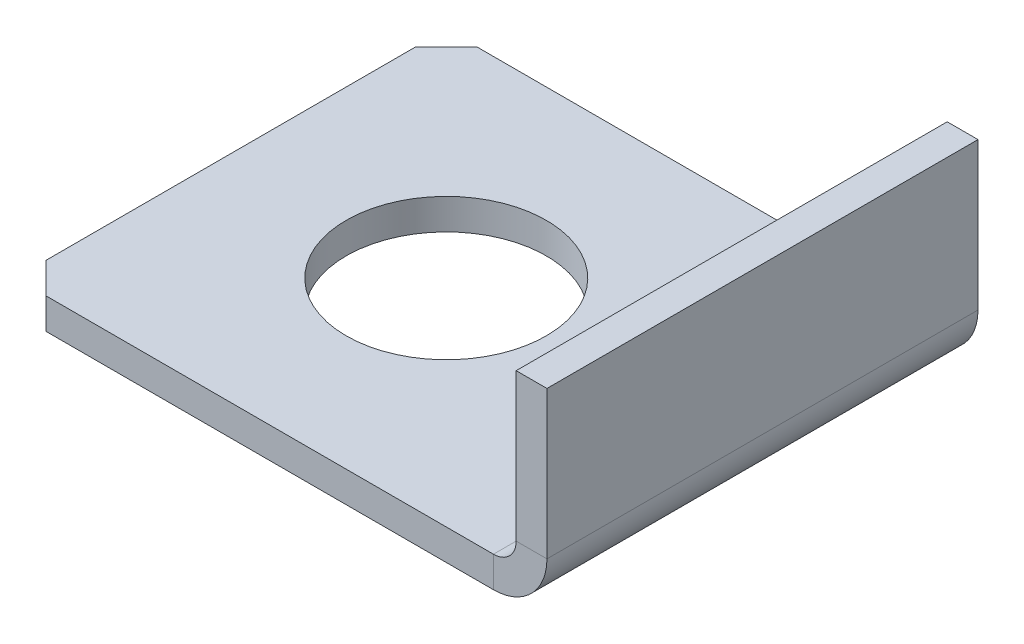
ISO-10303-21;
HEADER;
FILE_DESCRIPTION(('STEP AP214'),'2;1');
FILE_NAME('part.step','',(''),(''),'','','');
FILE_SCHEMA(('AUTOMOTIVE_DESIGN { 1 0 10303 214 1 1 1 1 }'));
ENDSEC;
DATA;
#1=APPLICATION_CONTEXT('core data for automotive mechanical design processes');
#2=APPLICATION_PROTOCOL_DEFINITION('international standard','automotive_design',2000,#1);
#3=PRODUCT_CONTEXT('',#1,'mechanical');
#4=PRODUCT('Part','Part','',(#3));
#5=PRODUCT_RELATED_PRODUCT_CATEGORY('part','',(#4));
#6=PRODUCT_DEFINITION_FORMATION('','',#4);
#7=PRODUCT_DEFINITION_CONTEXT('part definition',#1,'design');
#8=PRODUCT_DEFINITION('design','',#6,#7);
#9=PRODUCT_DEFINITION_SHAPE('','',#8);
#10=(LENGTH_UNIT() NAMED_UNIT(*) SI_UNIT(.MILLI.,.METRE.));
#11=(NAMED_UNIT(*) PLANE_ANGLE_UNIT() SI_UNIT($,.RADIAN.));
#12=(NAMED_UNIT(*) SI_UNIT($,.STERADIAN.) SOLID_ANGLE_UNIT());
#13=UNCERTAINTY_MEASURE_WITH_UNIT(LENGTH_MEASURE(1.E-05),#10,'distance_accuracy_value','');
#14=(GEOMETRIC_REPRESENTATION_CONTEXT(3) GLOBAL_UNCERTAINTY_ASSIGNED_CONTEXT((#13)) GLOBAL_UNIT_ASSIGNED_CONTEXT((#10,
#11,#12)) REPRESENTATION_CONTEXT('',''));
#15=CARTESIAN_POINT('',(0.,0.,0.));
#16=DIRECTION('',(0.,0.,1.));
#17=DIRECTION('',(1.,0.,0.));
#18=AXIS2_PLACEMENT_3D('',#15,#16,#17);
#19=CARTESIAN_POINT('',(22.27,0.,-14.));
#20=DIRECTION('',(0.,-1.,0.));
#21=DIRECTION('',(0.,0.,-1.));
#22=AXIS2_PLACEMENT_3D('',#19,#20,#21);
#23=PLANE('',#22);
#24=DIRECTION('',(0.,0.,-1.));
#25=VECTOR('',#24,1.);
#26=CARTESIAN_POINT('',(15.5334,0.,-14.));
#27=LINE('',#26,#25);
#28=CARTESIAN_POINT('',(15.5334,0.,0.));
#29=VERTEX_POINT('',#28);
#30=CARTESIAN_POINT('',(15.5334,0.,-14.));
#31=VERTEX_POINT('',#30);
#32=EDGE_CURVE('E183',#29,#31,#27,.T.);
#33=ORIENTED_EDGE('',*,*,#32,.F.);
#34=DIRECTION('',(1.,0.,0.));
#35=VECTOR('',#34,1.);
#36=CARTESIAN_POINT('',(1.,0.,0.));
#37=LINE('',#36,#35);
#38=CARTESIAN_POINT('',(1.,0.,0.));
#39=VERTEX_POINT('',#38);
#40=EDGE_CURVE('E149',#39,#29,#37,.T.);
#41=ORIENTED_EDGE('',*,*,#40,.F.);
#42=DIRECTION('',(0.707106781186548,0.,0.707106781186548));
#43=VECTOR('',#42,1.);
#44=CARTESIAN_POINT('',(0.,0.,-1.));
#45=LINE('',#44,#43);
#46=CARTESIAN_POINT('',(0.,0.,-1.));
#47=VERTEX_POINT('',#46);
#48=EDGE_CURVE('E181',#47,#39,#45,.T.);
#49=ORIENTED_EDGE('',*,*,#48,.F.);
#50=DIRECTION('',(0.,0.,1.));
#51=VECTOR('',#50,1.);
#52=CARTESIAN_POINT('',(0.,0.,-1.));
#53=LINE('',#52,#51);
#54=CARTESIAN_POINT('',(0.,0.,-13.));
#55=VERTEX_POINT('',#54);
#56=EDGE_CURVE('E176',#55,#47,#53,.T.);
#57=ORIENTED_EDGE('',*,*,#56,.F.);
#58=DIRECTION('',(-0.707106781186547,0.,0.707106781186548));
#59=VECTOR('',#58,1.);
#60=CARTESIAN_POINT('',(0.,0.,-13.));
#61=LINE('',#60,#59);
#62=CARTESIAN_POINT('',(1.,0.,-14.));
#63=VERTEX_POINT('',#62);
#64=EDGE_CURVE('E171',#63,#55,#61,.T.);
#65=ORIENTED_EDGE('',*,*,#64,.F.);
#66=DIRECTION('',(-1.,0.,0.));
#67=VECTOR('',#66,1.);
#68=CARTESIAN_POINT('',(1.,0.,-14.));
#69=LINE('',#68,#67);
#70=EDGE_CURVE('E155',#31,#63,#69,.T.);
#71=ORIENTED_EDGE('',*,*,#70,.F.);
#72=EDGE_LOOP('',(#33,#41,#49,#57,#65,#71));
#73=FACE_BOUND('',#72,.T.);
#74=CARTESIAN_POINT('',(7.,0.,-7.));
#75=DIRECTION('',(0.,1.,0.));
#76=DIRECTION('',(0.,0.,1.));
#77=AXIS2_PLACEMENT_3D('',#74,#75,#76);
#78=CIRCLE('',#77,3.25);
#79=CARTESIAN_POINT('',(7.,0.,-3.75));
#80=VERTEX_POINT('',#79);
#81=EDGE_CURVE('E224',#80,#80,#78,.T.);
#82=ORIENTED_EDGE('',*,*,#81,.T.);
#83=EDGE_LOOP('',(#82));
#84=FACE_BOUND('',#83,.T.);
#85=ADVANCED_FACE('F36',(#73,#84),#23,.T.);
#86=CARTESIAN_POINT('',(17.27,6.53075326228542,-14.));
#87=DIRECTION('',(1.,0.,0.));
#88=DIRECTION('',(0.,0.,-1.));
#89=AXIS2_PLACEMENT_3D('',#86,#87,#88);
#90=PLANE('',#89);
#91=DIRECTION('',(0.,1.,0.));
#92=VECTOR('',#91,1.);
#93=CARTESIAN_POINT('',(17.2700000000001,-14.7392467377146,0.));
#94=LINE('',#93,#92);
#95=CARTESIAN_POINT('',(17.27,1.7366,0.));
#96=VERTEX_POINT('',#95);
#97=CARTESIAN_POINT('',(17.27,6.53075326228542,0.));
#98=VERTEX_POINT('',#97);
#99=EDGE_CURVE('E53',#96,#98,#94,.T.);
#100=ORIENTED_EDGE('',*,*,#99,.F.);
#101=DIRECTION('',(0.,0.,-1.));
#102=VECTOR('',#101,1.);
#103=CARTESIAN_POINT('',(17.27,1.7366,-14.));
#104=LINE('',#103,#102);
#105=CARTESIAN_POINT('',(17.27,1.7366,-14.));
#106=VERTEX_POINT('',#105);
#107=EDGE_CURVE('E45',#96,#106,#104,.T.);
#108=ORIENTED_EDGE('',*,*,#107,.T.);
#109=DIRECTION('',(0.,-1.,0.));
#110=VECTOR('',#109,1.);
#111=CARTESIAN_POINT('',(17.2700000000001,-14.7392467377146,-14.));
#112=LINE('',#111,#110);
#113=CARTESIAN_POINT('',(17.27,6.53075326228542,-14.));
#114=VERTEX_POINT('',#113);
#115=EDGE_CURVE('E61',#114,#106,#112,.T.);
#116=ORIENTED_EDGE('',*,*,#115,.F.);
#117=DIRECTION('',(0.,0.,-1.));
#118=VECTOR('',#117,1.);
#119=CARTESIAN_POINT('',(17.27,6.53075326228542,0.));
#120=LINE('',#119,#118);
#121=EDGE_CURVE('E153',#98,#114,#120,.T.);
#122=ORIENTED_EDGE('',*,*,#121,.F.);
#123=EDGE_LOOP('',(#100,#108,#116,#122));
#124=FACE_BOUND('',#123,.T.);
#125=ADVANCED_FACE('F249',(#124),#90,.T.);
#126=CARTESIAN_POINT('',(16.27,6.53075326228542,0.));
#127=DIRECTION('',(0.,-1.,0.));
#128=DIRECTION('',(0.,0.,1.));
#129=AXIS2_PLACEMENT_3D('',#126,#127,#128);
#130=PLANE('',#129);
#131=ORIENTED_EDGE('',*,*,#121,.T.);
#132=DIRECTION('',(1.,0.,0.));
#133=VECTOR('',#132,1.);
#134=CARTESIAN_POINT('',(16.27,6.53075326228542,-14.));
#135=LINE('',#134,#133);
#136=CARTESIAN_POINT('',(16.27,6.53075326228542,-14.));
#137=VERTEX_POINT('',#136);
#138=EDGE_CURVE('E194',#137,#114,#135,.T.);
#139=ORIENTED_EDGE('',*,*,#138,.F.);
#140=DIRECTION('',(0.,0.,-1.));
#141=VECTOR('',#140,1.);
#142=CARTESIAN_POINT('',(16.27,6.53075326228542,0.));
#143=LINE('',#142,#141);
#144=CARTESIAN_POINT('',(16.27,6.53075326228542,0.));
#145=VERTEX_POINT('',#144);
#146=EDGE_CURVE('E185',#145,#137,#143,.T.);
#147=ORIENTED_EDGE('',*,*,#146,.F.);
#148=DIRECTION('',(1.,0.,0.));
#149=VECTOR('',#148,1.);
#150=CARTESIAN_POINT('',(16.27,6.53075326228542,0.));
#151=LINE('',#150,#149);
#152=EDGE_CURVE('E191',#145,#98,#151,.T.);
#153=ORIENTED_EDGE('',*,*,#152,.T.);
#154=EDGE_LOOP('',(#131,#139,#147,#153));
#155=FACE_BOUND('',#154,.T.);
#156=ADVANCED_FACE('F212',(#155),#130,.F.);
#157=CARTESIAN_POINT('',(16.2700000000001,-14.7392467377146,-14.));
#158=DIRECTION('',(0.,0.,1.));
#159=DIRECTION('',(0.,1.,0.));
#160=AXIS2_PLACEMENT_3D('',#157,#158,#159);
#161=PLANE('',#160);
#162=DIRECTION('',(1.,0.,0.));
#163=VECTOR('',#162,1.);
#164=CARTESIAN_POINT('',(16.27,1.7366,-14.));
#165=LINE('',#164,#163);
#166=CARTESIAN_POINT('',(16.27,1.7366,-14.));
#167=VERTEX_POINT('',#166);
#168=EDGE_CURVE('E198',#167,#106,#165,.T.);
#169=ORIENTED_EDGE('',*,*,#168,.F.);
#170=DIRECTION('',(0.,-1.,0.));
#171=VECTOR('',#170,1.);
#172=CARTESIAN_POINT('',(16.2700000000001,-14.7392467377146,-14.));
#173=LINE('',#172,#171);
#174=EDGE_CURVE('E188',#137,#167,#173,.T.);
#175=ORIENTED_EDGE('',*,*,#174,.F.);
#176=ORIENTED_EDGE('',*,*,#138,.T.);
#177=ORIENTED_EDGE('',*,*,#115,.T.);
#178=EDGE_LOOP('',(#169,#175,#176,#177));
#179=FACE_BOUND('',#178,.T.);
#180=ADVANCED_FACE('F213',(#179),#161,.F.);
#181=CARTESIAN_POINT('',(16.2700000000001,-14.7392467377146,0.));
#182=DIRECTION('',(0.,0.,-1.));
#183=DIRECTION('',(0.,-1.,0.));
#184=AXIS2_PLACEMENT_3D('',#181,#182,#183);
#185=PLANE('',#184);
#186=DIRECTION('',(-1.,0.,0.));
#187=VECTOR('',#186,1.);
#188=CARTESIAN_POINT('',(16.27,1.7366,0.));
#189=LINE('',#188,#187);
#190=CARTESIAN_POINT('',(16.27,1.7366,0.));
#191=VERTEX_POINT('',#190);
#192=EDGE_CURVE('E12',#96,#191,#189,.T.);
#193=ORIENTED_EDGE('',*,*,#192,.F.);
#194=ORIENTED_EDGE('',*,*,#99,.T.);
#195=ORIENTED_EDGE('',*,*,#152,.F.);
#196=DIRECTION('',(0.,1.,0.));
#197=VECTOR('',#196,1.);
#198=CARTESIAN_POINT('',(16.2700000000001,-14.7392467377146,0.));
#199=LINE('',#198,#197);
#200=EDGE_CURVE('E40',#191,#145,#199,.T.);
#201=ORIENTED_EDGE('',*,*,#200,.F.);
#202=EDGE_LOOP('',(#193,#194,#195,#201));
#203=FACE_BOUND('',#202,.T.);
#204=ADVANCED_FACE('F38',(#203),#185,.F.);
#205=CARTESIAN_POINT('',(16.27,6.53075326228542,-14.));
#206=DIRECTION('',(1.,0.,0.));
#207=DIRECTION('',(0.,0.,-1.));
#208=AXIS2_PLACEMENT_3D('',#205,#206,#207);
#209=PLANE('',#208);
#210=DIRECTION('',(0.,0.,-1.));
#211=VECTOR('',#210,1.);
#212=CARTESIAN_POINT('',(16.27,1.7366,-14.));
#213=LINE('',#212,#211);
#214=EDGE_CURVE('E196',#191,#167,#213,.T.);
#215=ORIENTED_EDGE('',*,*,#214,.F.);
#216=ORIENTED_EDGE('',*,*,#200,.T.);
#217=ORIENTED_EDGE('',*,*,#146,.T.);
#218=ORIENTED_EDGE('',*,*,#174,.T.);
#219=EDGE_LOOP('',(#215,#216,#217,#218));
#220=FACE_BOUND('',#219,.T.);
#221=ADVANCED_FACE('F207',(#220),#209,.F.);
#222=CARTESIAN_POINT('',(0.,1.,-1.));
#223=DIRECTION('',(0.707106781186547,0.,-0.707106781186547));
#224=DIRECTION('',(-0.707106781186548,0.,-0.707106781186548));
#225=AXIS2_PLACEMENT_3D('',#222,#223,#224);
#226=PLANE('',#225);
#227=ORIENTED_EDGE('',*,*,#48,.T.);
#228=DIRECTION('',(0.,-1.,0.));
#229=VECTOR('',#228,1.);
#230=CARTESIAN_POINT('',(1.,1.,0.));
#231=LINE('',#230,#229);
#232=CARTESIAN_POINT('',(1.,1.,0.));
#233=VERTEX_POINT('',#232);
#234=EDGE_CURVE('E151',#233,#39,#231,.T.);
#235=ORIENTED_EDGE('',*,*,#234,.F.);
#236=DIRECTION('',(0.707106781186548,0.,0.707106781186548));
#237=VECTOR('',#236,1.);
#238=CARTESIAN_POINT('',(0.,1.,-1.));
#239=LINE('',#238,#237);
#240=CARTESIAN_POINT('',(0.,1.,-1.));
#241=VERTEX_POINT('',#240);
#242=EDGE_CURVE('E140',#241,#233,#239,.T.);
#243=ORIENTED_EDGE('',*,*,#242,.F.);
#244=DIRECTION('',(0.,-1.,0.));
#245=VECTOR('',#244,1.);
#246=CARTESIAN_POINT('',(0.,1.,-1.));
#247=LINE('',#246,#245);
#248=EDGE_CURVE('E178',#241,#47,#247,.T.);
#249=ORIENTED_EDGE('',*,*,#248,.T.);
#250=EDGE_LOOP('',(#227,#235,#243,#249));
#251=FACE_BOUND('',#250,.T.);
#252=ADVANCED_FACE('F263',(#251),#226,.F.);
#253=CARTESIAN_POINT('',(0.,1.,-1.));
#254=DIRECTION('',(1.,0.,0.));
#255=DIRECTION('',(0.,0.,-1.));
#256=AXIS2_PLACEMENT_3D('',#253,#254,#255);
#257=PLANE('',#256);
#258=ORIENTED_EDGE('',*,*,#56,.T.);
#259=ORIENTED_EDGE('',*,*,#248,.F.);
#260=DIRECTION('',(0.,0.,1.));
#261=VECTOR('',#260,1.);
#262=CARTESIAN_POINT('',(0.,1.,-1.));
#263=LINE('',#262,#261);
#264=CARTESIAN_POINT('',(0.,1.,-13.));
#265=VERTEX_POINT('',#264);
#266=EDGE_CURVE('E164',#265,#241,#263,.T.);
#267=ORIENTED_EDGE('',*,*,#266,.F.);
#268=DIRECTION('',(0.,-1.,0.));
#269=VECTOR('',#268,1.);
#270=CARTESIAN_POINT('',(0.,1.,-13.));
#271=LINE('',#270,#269);
#272=EDGE_CURVE('E173',#265,#55,#271,.T.);
#273=ORIENTED_EDGE('',*,*,#272,.T.);
#274=EDGE_LOOP('',(#258,#259,#267,#273));
#275=FACE_BOUND('',#274,.T.);
#276=ADVANCED_FACE('F245',(#275),#257,.F.);
#277=CARTESIAN_POINT('',(0.,1.,-13.));
#278=DIRECTION('',(0.707106781186548,0.,0.707106781186547));
#279=DIRECTION('',(0.707106781186547,0.,-0.707106781186548));
#280=AXIS2_PLACEMENT_3D('',#277,#278,#279);
#281=PLANE('',#280);
#282=ORIENTED_EDGE('',*,*,#64,.T.);
#283=ORIENTED_EDGE('',*,*,#272,.F.);
#284=DIRECTION('',(-0.707106781186547,0.,0.707106781186548));
#285=VECTOR('',#284,1.);
#286=CARTESIAN_POINT('',(0.,1.,-13.));
#287=LINE('',#286,#285);
#288=CARTESIAN_POINT('',(1.,1.,-14.));
#289=VERTEX_POINT('',#288);
#290=EDGE_CURVE('E166',#289,#265,#287,.T.);
#291=ORIENTED_EDGE('',*,*,#290,.F.);
#292=DIRECTION('',(0.,-1.,0.));
#293=VECTOR('',#292,1.);
#294=CARTESIAN_POINT('',(1.,1.,-14.));
#295=LINE('',#294,#293);
#296=EDGE_CURVE('E144',#289,#63,#295,.T.);
#297=ORIENTED_EDGE('',*,*,#296,.T.);
#298=EDGE_LOOP('',(#282,#283,#291,#297));
#299=FACE_BOUND('',#298,.T.);
#300=ADVANCED_FACE('F237',(#299),#281,.F.);
#301=CARTESIAN_POINT('',(22.27,1.,-14.));
#302=DIRECTION('',(0.,-1.,0.));
#303=DIRECTION('',(0.,0.,-1.));
#304=AXIS2_PLACEMENT_3D('',#301,#302,#303);
#305=PLANE('',#304);
#306=CARTESIAN_POINT('',(7.,1.,-7.));
#307=DIRECTION('',(0.,1.,0.));
#308=DIRECTION('',(0.,0.,1.));
#309=AXIS2_PLACEMENT_3D('',#306,#307,#308);
#310=CIRCLE('',#309,3.24999999999999);
#311=CARTESIAN_POINT('',(7.,1.,-3.75000000000001));
#312=VERTEX_POINT('',#311);
#313=EDGE_CURVE('E229',#312,#312,#310,.T.);
#314=ORIENTED_EDGE('',*,*,#313,.F.);
#315=EDGE_LOOP('',(#314));
#316=FACE_BOUND('',#315,.T.);
#317=DIRECTION('',(1.,0.,0.));
#318=VECTOR('',#317,1.);
#319=CARTESIAN_POINT('',(1.,1.,0.));
#320=LINE('',#319,#318);
#321=CARTESIAN_POINT('',(15.5334,1.,0.));
#322=VERTEX_POINT('',#321);
#323=EDGE_CURVE('E135',#233,#322,#320,.T.);
#324=ORIENTED_EDGE('',*,*,#323,.T.);
#325=DIRECTION('',(0.,0.,-1.));
#326=VECTOR('',#325,1.);
#327=CARTESIAN_POINT('',(15.5334,1.,-14.));
#328=LINE('',#327,#326);
#329=CARTESIAN_POINT('',(15.5334,1.,-14.));
#330=VERTEX_POINT('',#329);
#331=EDGE_CURVE('E128',#322,#330,#328,.T.);
#332=ORIENTED_EDGE('',*,*,#331,.T.);
#333=DIRECTION('',(-1.,0.,0.));
#334=VECTOR('',#333,1.);
#335=CARTESIAN_POINT('',(1.,1.,-14.));
#336=LINE('',#335,#334);
#337=EDGE_CURVE('E134',#330,#289,#336,.T.);
#338=ORIENTED_EDGE('',*,*,#337,.T.);
#339=ORIENTED_EDGE('',*,*,#290,.T.);
#340=ORIENTED_EDGE('',*,*,#266,.T.);
#341=ORIENTED_EDGE('',*,*,#242,.T.);
#342=EDGE_LOOP('',(#324,#332,#338,#339,#340,#341));
#343=FACE_BOUND('',#342,.T.);
#344=ADVANCED_FACE('F138',(#316,#343),#305,.F.);
#345=CARTESIAN_POINT('',(1.,1.,-14.));
#346=DIRECTION('',(0.,0.,1.));
#347=DIRECTION('',(1.,0.,0.));
#348=AXIS2_PLACEMENT_3D('',#345,#346,#347);
#349=PLANE('',#348);
#350=ORIENTED_EDGE('',*,*,#337,.F.);
#351=DIRECTION('',(0.,-1.,0.));
#352=VECTOR('',#351,1.);
#353=CARTESIAN_POINT('',(15.5334,1.,-14.));
#354=LINE('',#353,#352);
#355=EDGE_CURVE('E160',#330,#31,#354,.T.);
#356=ORIENTED_EDGE('',*,*,#355,.T.);
#357=ORIENTED_EDGE('',*,*,#70,.T.);
#358=ORIENTED_EDGE('',*,*,#296,.F.);
#359=EDGE_LOOP('',(#350,#356,#357,#358));
#360=FACE_BOUND('',#359,.T.);
#361=ADVANCED_FACE('F236',(#360),#349,.F.);
#362=CARTESIAN_POINT('',(1.,1.,0.));
#363=DIRECTION('',(0.,0.,-1.));
#364=DIRECTION('',(-1.,0.,0.));
#365=AXIS2_PLACEMENT_3D('',#362,#363,#364);
#366=PLANE('',#365);
#367=ORIENTED_EDGE('',*,*,#40,.T.);
#368=DIRECTION('',(0.,1.,0.));
#369=VECTOR('',#368,1.);
#370=CARTESIAN_POINT('',(15.5334,1.,0.));
#371=LINE('',#370,#369);
#372=EDGE_CURVE('E119',#29,#322,#371,.T.);
#373=ORIENTED_EDGE('',*,*,#372,.T.);
#374=ORIENTED_EDGE('',*,*,#323,.F.);
#375=ORIENTED_EDGE('',*,*,#234,.T.);
#376=EDGE_LOOP('',(#367,#373,#374,#375));
#377=FACE_BOUND('',#376,.T.);
#378=ADVANCED_FACE('F147',(#377),#366,.F.);
#379=CARTESIAN_POINT('',(15.5334,1.7366,0.));
#380=DIRECTION('',(0.,0.,-1.));
#381=DIRECTION('',(-1.,0.,0.));
#382=AXIS2_PLACEMENT_3D('',#379,#380,#381);
#383=PLANE('',#382);
#384=ORIENTED_EDGE('',*,*,#372,.F.);
#385=CARTESIAN_POINT('',(15.5334,1.7366,0.));
#386=DIRECTION('',(0.,0.,-1.));
#387=DIRECTION('',(-1.,0.,0.));
#388=AXIS2_PLACEMENT_3D('',#385,#386,#387);
#389=CIRCLE('',#388,1.7366);
#390=EDGE_CURVE('E222',#29,#96,#389,.F.);
#391=ORIENTED_EDGE('',*,*,#390,.T.);
#392=ORIENTED_EDGE('',*,*,#192,.T.);
#393=CARTESIAN_POINT('',(15.5334,1.7366,0.));
#394=DIRECTION('',(0.,0.,1.));
#395=DIRECTION('',(1.,0.,0.));
#396=AXIS2_PLACEMENT_3D('',#393,#394,#395);
#397=CIRCLE('',#396,0.7366);
#398=EDGE_CURVE('E114',#322,#191,#397,.T.);
#399=ORIENTED_EDGE('',*,*,#398,.F.);
#400=EDGE_LOOP('',(#384,#391,#392,#399));
#401=FACE_BOUND('',#400,.T.);
#402=ADVANCED_FACE('F116',(#401),#383,.F.);
#403=CARTESIAN_POINT('',(15.5334,1.7366,-14.));
#404=DIRECTION('',(0.,0.,1.));
#405=DIRECTION('',(1.,0.,0.));
#406=AXIS2_PLACEMENT_3D('',#403,#404,#405);
#407=PLANE('',#406);
#408=ORIENTED_EDGE('',*,*,#168,.T.);
#409=CARTESIAN_POINT('',(15.5334,1.7366,-14.));
#410=DIRECTION('',(0.,0.,-1.));
#411=DIRECTION('',(-1.,0.,0.));
#412=AXIS2_PLACEMENT_3D('',#409,#410,#411);
#413=CIRCLE('',#412,1.7366);
#414=EDGE_CURVE('E124',#106,#31,#413,.T.);
#415=ORIENTED_EDGE('',*,*,#414,.T.);
#416=ORIENTED_EDGE('',*,*,#355,.F.);
#417=CARTESIAN_POINT('',(15.5334,1.7366,-14.));
#418=DIRECTION('',(0.,0.,-1.));
#419=DIRECTION('',(-1.,0.,0.));
#420=AXIS2_PLACEMENT_3D('',#417,#418,#419);
#421=CIRCLE('',#420,0.7366);
#422=EDGE_CURVE('E123',#167,#330,#421,.T.);
#423=ORIENTED_EDGE('',*,*,#422,.F.);
#424=EDGE_LOOP('',(#408,#415,#416,#423));
#425=FACE_BOUND('',#424,.T.);
#426=ADVANCED_FACE('F217',(#425),#407,.F.);
#427=CARTESIAN_POINT('',(15.5334,1.7366,7.16944244947055));
#428=DIRECTION('',(0.,0.,-1.));
#429=DIRECTION('',(-1.,0.,0.));
#430=AXIS2_PLACEMENT_3D('',#427,#428,#429);
#431=CYLINDRICAL_SURFACE('',#430,0.7366);
#432=ORIENTED_EDGE('',*,*,#422,.T.);
#433=ORIENTED_EDGE('',*,*,#331,.F.);
#434=ORIENTED_EDGE('',*,*,#398,.T.);
#435=ORIENTED_EDGE('',*,*,#214,.T.);
#436=EDGE_LOOP('',(#432,#433,#434,#435));
#437=FACE_BOUND('',#436,.T.);
#438=ADVANCED_FACE('F130',(#437),#431,.F.);
#439=CARTESIAN_POINT('',(15.5334,1.7366,7.16944244947055));
#440=DIRECTION('',(0.,0.,-1.));
#441=DIRECTION('',(-1.,0.,0.));
#442=AXIS2_PLACEMENT_3D('',#439,#440,#441);
#443=CYLINDRICAL_SURFACE('',#442,1.7366);
#444=ORIENTED_EDGE('',*,*,#414,.F.);
#445=ORIENTED_EDGE('',*,*,#107,.F.);
#446=ORIENTED_EDGE('',*,*,#390,.F.);
#447=ORIENTED_EDGE('',*,*,#32,.T.);
#448=EDGE_LOOP('',(#444,#445,#446,#447));
#449=FACE_BOUND('',#448,.T.);
#450=ADVANCED_FACE('F221',(#449),#443,.T.);
#451=CARTESIAN_POINT('',(7.,1.,-7.));
#452=DIRECTION('',(0.,1.,0.));
#453=DIRECTION('',(0.,0.,1.));
#454=AXIS2_PLACEMENT_3D('',#451,#452,#453);
#455=CYLINDRICAL_SURFACE('',#454,3.24999999999999);
#456=ORIENTED_EDGE('',*,*,#81,.F.);
#457=EDGE_LOOP('',(#456));
#458=FACE_BOUND('',#457,.T.);
#459=ORIENTED_EDGE('',*,*,#313,.T.);
#460=EDGE_LOOP('',(#459));
#461=FACE_BOUND('',#460,.T.);
#462=ADVANCED_FACE('F233',(#458,#461),#455,.F.);
#463=CLOSED_SHELL('',(#85,#125,#156,#180,#204,#221,#252,#276,#300,#344,#361,#378,#402,#426,#438,
#450,#462));
#464=MANIFOLD_SOLID_BREP('B2',#463);
#465=ADVANCED_BREP_SHAPE_REPRESENTATION('',(#18,#464),#14);
#466=SHAPE_DEFINITION_REPRESENTATION(#9,#465);
ENDSEC;
END-ISO-10303-21;
